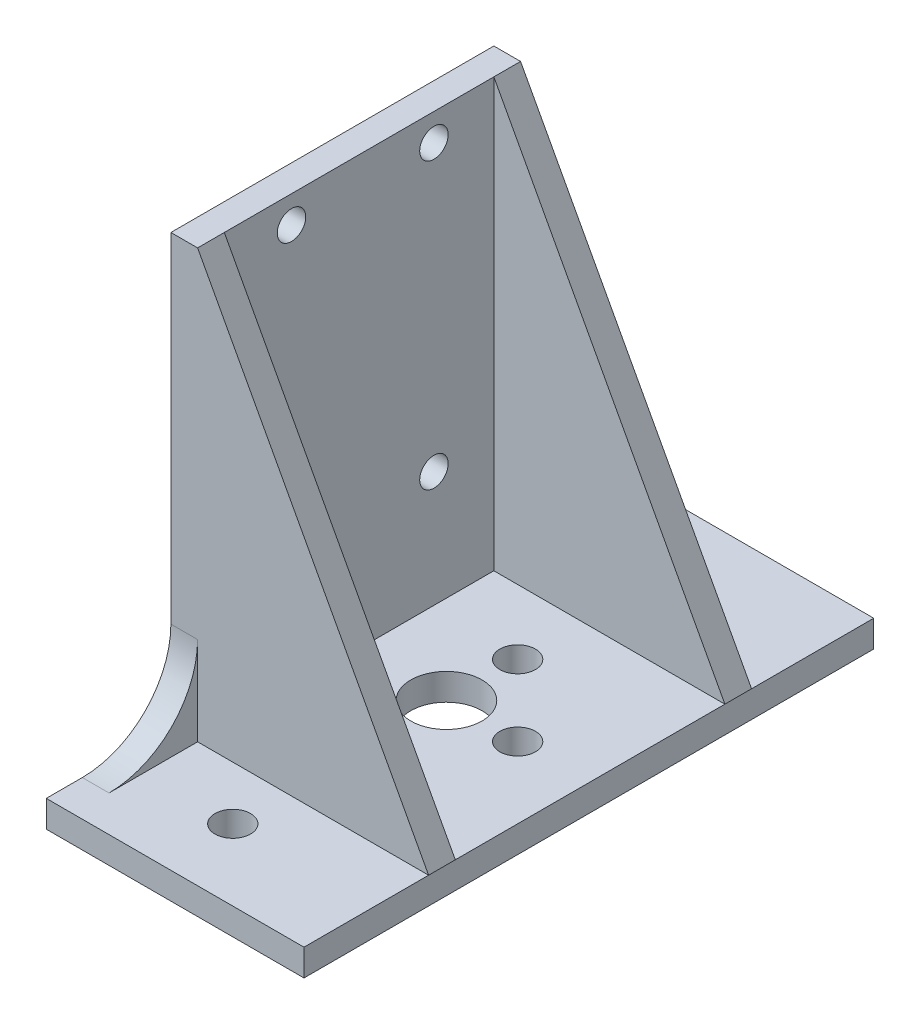
ISO-10303-21;
HEADER;
FILE_DESCRIPTION(('STEP AP214'),'2;1');
FILE_NAME('part.step','',(''),(''),'','','');
FILE_SCHEMA(('AUTOMOTIVE_DESIGN { 1 0 10303 214 1 1 1 1 }'));
ENDSEC;
DATA;
#1=APPLICATION_CONTEXT('core data for automotive mechanical design processes');
#2=APPLICATION_PROTOCOL_DEFINITION('international standard','automotive_design',2000,#1);
#3=PRODUCT_CONTEXT('',#1,'mechanical');
#4=PRODUCT('Part','Part','',(#3));
#5=PRODUCT_RELATED_PRODUCT_CATEGORY('part','',(#4));
#6=PRODUCT_DEFINITION_FORMATION('','',#4);
#7=PRODUCT_DEFINITION_CONTEXT('part definition',#1,'design');
#8=PRODUCT_DEFINITION('design','',#6,#7);
#9=PRODUCT_DEFINITION_SHAPE('','',#8);
#10=(LENGTH_UNIT() NAMED_UNIT(*) SI_UNIT(.MILLI.,.METRE.));
#11=(NAMED_UNIT(*) PLANE_ANGLE_UNIT() SI_UNIT($,.RADIAN.));
#12=(NAMED_UNIT(*) SI_UNIT($,.STERADIAN.) SOLID_ANGLE_UNIT());
#13=UNCERTAINTY_MEASURE_WITH_UNIT(LENGTH_MEASURE(1.E-05),#10,'distance_accuracy_value','');
#14=(GEOMETRIC_REPRESENTATION_CONTEXT(3) GLOBAL_UNCERTAINTY_ASSIGNED_CONTEXT((#13)) GLOBAL_UNIT_ASSIGNED_CONTEXT((#10,
#11,#12)) REPRESENTATION_CONTEXT('',''));
#15=CARTESIAN_POINT('',(0.,0.,0.));
#16=DIRECTION('',(0.,0.,1.));
#17=DIRECTION('',(1.,0.,0.));
#18=AXIS2_PLACEMENT_3D('',#15,#16,#17);
#19=CARTESIAN_POINT('',(0.,3.,0.));
#20=DIRECTION('',(0.,1.,0.));
#21=DIRECTION('',(0.,0.,1.));
#22=AXIS2_PLACEMENT_3D('',#19,#20,#21);
#23=PLANE('',#22);
#24=CARTESIAN_POINT('',(0.,3.,8.));
#25=DIRECTION('',(0.,1.,0.));
#26=DIRECTION('',(0.,0.,1.));
#27=AXIS2_PLACEMENT_3D('',#24,#25,#26);
#28=CIRCLE('',#27,2.);
#29=CARTESIAN_POINT('',(0.,3.,10.));
#30=VERTEX_POINT('',#29);
#31=EDGE_CURVE('E221',#30,#30,#28,.T.);
#32=ORIENTED_EDGE('',*,*,#31,.F.);
#33=EDGE_LOOP('',(#32));
#34=FACE_BOUND('',#33,.T.);
#35=CARTESIAN_POINT('',(8.,3.,0.));
#36=DIRECTION('',(0.,1.,0.));
#37=DIRECTION('',(0.,0.,1.));
#38=AXIS2_PLACEMENT_3D('',#35,#36,#37);
#39=CIRCLE('',#38,2.);
#40=CARTESIAN_POINT('',(8.,3.,2.));
#41=VERTEX_POINT('',#40);
#42=EDGE_CURVE('E215',#41,#41,#39,.T.);
#43=ORIENTED_EDGE('',*,*,#42,.F.);
#44=EDGE_LOOP('',(#43));
#45=FACE_BOUND('',#44,.T.);
#46=CARTESIAN_POINT('',(0.,3.,-8.));
#47=DIRECTION('',(0.,1.,0.));
#48=DIRECTION('',(0.,0.,1.));
#49=AXIS2_PLACEMENT_3D('',#46,#47,#48);
#50=CIRCLE('',#49,2.);
#51=CARTESIAN_POINT('',(0.,3.,-6.));
#52=VERTEX_POINT('',#51);
#53=EDGE_CURVE('E210',#52,#52,#50,.T.);
#54=ORIENTED_EDGE('',*,*,#53,.F.);
#55=EDGE_LOOP('',(#54));
#56=FACE_BOUND('',#55,.T.);
#57=CARTESIAN_POINT('',(0.,3.,0.));
#58=DIRECTION('',(0.,1.,0.));
#59=DIRECTION('',(0.,0.,1.));
#60=AXIS2_PLACEMENT_3D('',#57,#58,#59);
#61=CIRCLE('',#60,4.);
#62=CARTESIAN_POINT('',(0.,3.,4.));
#63=VERTEX_POINT('',#62);
#64=EDGE_CURVE('E203',#63,#63,#61,.T.);
#65=ORIENTED_EDGE('',*,*,#64,.F.);
#66=EDGE_LOOP('',(#65));
#67=FACE_BOUND('',#66,.T.);
#68=DIRECTION('',(0.,0.,1.));
#69=VECTOR('',#68,1.);
#70=CARTESIAN_POINT('',(16.,3.,0.));
#71=LINE('',#70,#69);
#72=CARTESIAN_POINT('',(16.,2.99999999999999,-15.278));
#73=VERTEX_POINT('',#72);
#74=CARTESIAN_POINT('',(16.,3.,15.));
#75=VERTEX_POINT('',#74);
#76=EDGE_CURVE('E194',#73,#75,#71,.T.);
#77=ORIENTED_EDGE('',*,*,#76,.F.);
#78=DIRECTION('',(-1.,0.,0.));
#79=VECTOR('',#78,1.);
#80=CARTESIAN_POINT('',(0.,3.,-15.278));
#81=LINE('',#80,#79);
#82=CARTESIAN_POINT('',(-9.95,3.,-15.278));
#83=VERTEX_POINT('',#82);
#84=EDGE_CURVE('E161',#73,#83,#81,.T.);
#85=ORIENTED_EDGE('',*,*,#84,.T.);
#86=DIRECTION('',(0.,0.,-1.));
#87=VECTOR('',#86,1.);
#88=CARTESIAN_POINT('',(-9.95,3.,0.));
#89=LINE('',#88,#87);
#90=CARTESIAN_POINT('',(-9.95,3.,15.));
#91=VERTEX_POINT('',#90);
#92=EDGE_CURVE('E237',#91,#83,#89,.T.);
#93=ORIENTED_EDGE('',*,*,#92,.F.);
#94=DIRECTION('',(1.,0.,0.));
#95=VECTOR('',#94,1.);
#96=CARTESIAN_POINT('',(0.,3.,15.));
#97=LINE('',#96,#95);
#98=EDGE_CURVE('E55',#91,#75,#97,.T.);
#99=ORIENTED_EDGE('',*,*,#98,.T.);
#100=EDGE_LOOP('',(#77,#85,#93,#99));
#101=FACE_BOUND('',#100,.T.);
#102=ADVANCED_FACE('F39',(#34,#45,#56,#67,#101),#23,.T.);
#103=CARTESIAN_POINT('',(-9.95,12.95,-28.228));
#104=DIRECTION('',(1.,0.,0.));
#105=DIRECTION('',(0.,0.,-1.));
#106=AXIS2_PLACEMENT_3D('',#103,#104,#105);
#107=PLANE('',#106);
#108=CARTESIAN_POINT('',(-9.95,48.,7.45199999999999));
#109=DIRECTION('',(-1.,0.,0.));
#110=DIRECTION('',(0.,0.,1.));
#111=AXIS2_PLACEMENT_3D('',#108,#109,#110);
#112=CIRCLE('',#111,1.6);
#113=CARTESIAN_POINT('',(-9.95,48.,9.05199999999999));
#114=VERTEX_POINT('',#113);
#115=EDGE_CURVE('E310',#114,#114,#112,.T.);
#116=ORIENTED_EDGE('',*,*,#115,.T.);
#117=EDGE_LOOP('',(#116));
#118=FACE_BOUND('',#117,.T.);
#119=CARTESIAN_POINT('',(-9.95,16.,7.45199999999999));
#120=DIRECTION('',(-1.,0.,0.));
#121=DIRECTION('',(0.,0.,1.));
#122=AXIS2_PLACEMENT_3D('',#119,#120,#121);
#123=CIRCLE('',#122,1.6);
#124=CARTESIAN_POINT('',(-9.95,16.,9.052));
#125=VERTEX_POINT('',#124);
#126=EDGE_CURVE('E302',#125,#125,#123,.T.);
#127=ORIENTED_EDGE('',*,*,#126,.T.);
#128=EDGE_LOOP('',(#127));
#129=FACE_BOUND('',#128,.T.);
#130=CARTESIAN_POINT('',(-9.95,16.,-8.54800000000001));
#131=DIRECTION('',(-1.,0.,0.));
#132=DIRECTION('',(0.,0.,1.));
#133=AXIS2_PLACEMENT_3D('',#130,#131,#132);
#134=CIRCLE('',#133,1.6);
#135=CARTESIAN_POINT('',(-9.95,16.,-6.94800000000001));
#136=VERTEX_POINT('',#135);
#137=EDGE_CURVE('E294',#136,#136,#134,.T.);
#138=ORIENTED_EDGE('',*,*,#137,.T.);
#139=EDGE_LOOP('',(#138));
#140=FACE_BOUND('',#139,.T.);
#141=CARTESIAN_POINT('',(-9.95,48.,-8.54800000000001));
#142=DIRECTION('',(-1.,0.,0.));
#143=DIRECTION('',(0.,0.,1.));
#144=AXIS2_PLACEMENT_3D('',#141,#142,#143);
#145=CIRCLE('',#144,1.6);
#146=CARTESIAN_POINT('',(-9.95,48.,-6.94800000000001));
#147=VERTEX_POINT('',#146);
#148=EDGE_CURVE('E277',#147,#147,#145,.T.);
#149=ORIENTED_EDGE('',*,*,#148,.T.);
#150=EDGE_LOOP('',(#149));
#151=FACE_BOUND('',#150,.T.);
#152=ORIENTED_EDGE('',*,*,#92,.T.);
#153=DIRECTION('',(0.,1.,0.));
#154=VECTOR('',#153,1.);
#155=CARTESIAN_POINT('',(-9.95,12.95,-15.278));
#156=LINE('',#155,#154);
#157=CARTESIAN_POINT('',(-9.95,51.05,-15.278));
#158=VERTEX_POINT('',#157);
#159=EDGE_CURVE('E185',#83,#158,#156,.T.);
#160=ORIENTED_EDGE('',*,*,#159,.T.);
#161=DIRECTION('',(0.,0.,-1.));
#162=VECTOR('',#161,1.);
#163=CARTESIAN_POINT('',(-9.95,51.05,-18.278));
#164=LINE('',#163,#162);
#165=CARTESIAN_POINT('',(-9.95,51.05,15.));
#166=VERTEX_POINT('',#165);
#167=EDGE_CURVE('E281',#166,#158,#164,.T.);
#168=ORIENTED_EDGE('',*,*,#167,.F.);
#169=DIRECTION('',(0.,-1.,0.));
#170=VECTOR('',#169,1.);
#171=CARTESIAN_POINT('',(-9.95,12.95,15.));
#172=LINE('',#171,#170);
#173=EDGE_CURVE('E48',#166,#91,#172,.T.);
#174=ORIENTED_EDGE('',*,*,#173,.T.);
#175=EDGE_LOOP('',(#152,#160,#168,#174));
#176=FACE_BOUND('',#175,.T.);
#177=ADVANCED_FACE('F406',(#118,#129,#140,#151,#176),#107,.T.);
#178=DIRECTION('',(-1.,0.,0.));
#179=VECTOR('',#178,1.);
#180=CARTESIAN_POINT('',(0.,3.,-18.278));
#181=LINE('',#180,#179);
#182=CARTESIAN_POINT('',(16.,2.99999999999999,-18.278));
#183=VERTEX_POINT('',#182);
#184=CARTESIAN_POINT('',(-9.95,3.,-18.278));
#185=VERTEX_POINT('',#184);
#186=EDGE_CURVE('E168',#183,#185,#181,.T.);
#187=ORIENTED_EDGE('',*,*,#186,.F.);
#188=CARTESIAN_POINT('',(16.,3.,-32.));
#189=VERTEX_POINT('',#188);
#190=EDGE_CURVE('E181',#189,#183,#71,.T.);
#191=ORIENTED_EDGE('',*,*,#190,.F.);
#192=DIRECTION('',(1.,0.,0.));
#193=VECTOR('',#192,1.);
#194=CARTESIAN_POINT('',(0.,3.,-32.));
#195=LINE('',#194,#193);
#196=CARTESIAN_POINT('',(-12.95,3.,-32.));
#197=VERTEX_POINT('',#196);
#198=EDGE_CURVE('E193',#197,#189,#195,.T.);
#199=ORIENTED_EDGE('',*,*,#198,.F.);
#200=DIRECTION('',(0.,0.,1.));
#201=VECTOR('',#200,1.);
#202=CARTESIAN_POINT('',(-12.95,3.,0.));
#203=LINE('',#202,#201);
#204=CARTESIAN_POINT('',(-12.95,3.,-28.228));
#205=VERTEX_POINT('',#204);
#206=EDGE_CURVE('E434',#197,#205,#203,.T.);
#207=ORIENTED_EDGE('',*,*,#206,.T.);
#208=DIRECTION('',(-1.,0.,0.));
#209=VECTOR('',#208,1.);
#210=CARTESIAN_POINT('',(-9.95,3.,-28.228));
#211=LINE('',#210,#209);
#212=CARTESIAN_POINT('',(-9.95,3.,-28.228));
#213=VERTEX_POINT('',#212);
#214=EDGE_CURVE('E241',#213,#205,#211,.T.);
#215=ORIENTED_EDGE('',*,*,#214,.F.);
#216=EDGE_CURVE('E183',#185,#213,#89,.T.);
#217=ORIENTED_EDGE('',*,*,#216,.F.);
#218=EDGE_LOOP('',(#187,#191,#199,#207,#215,#217));
#219=FACE_BOUND('',#218,.T.);
#220=CARTESIAN_POINT('',(0.,3.,-24.));
#221=DIRECTION('',(0.,1.,0.));
#222=DIRECTION('',(0.,0.,1.));
#223=AXIS2_PLACEMENT_3D('',#220,#221,#222);
#224=CIRCLE('',#223,2.);
#225=CARTESIAN_POINT('',(0.,3.,-22.));
#226=VERTEX_POINT('',#225);
#227=EDGE_CURVE('E225',#226,#226,#224,.T.);
#228=ORIENTED_EDGE('',*,*,#227,.F.);
#229=EDGE_LOOP('',(#228));
#230=FACE_BOUND('',#229,.T.);
#231=ADVANCED_FACE('F178',(#219,#230),#23,.T.);
#232=DIRECTION('',(0.,1.,0.));
#233=VECTOR('',#232,1.);
#234=CARTESIAN_POINT('',(-9.95,12.95,-18.278));
#235=LINE('',#234,#233);
#236=CARTESIAN_POINT('',(-9.95,12.95,-18.278));
#237=VERTEX_POINT('',#236);
#238=EDGE_CURVE('E173',#185,#237,#235,.T.);
#239=ORIENTED_EDGE('',*,*,#238,.F.);
#240=ORIENTED_EDGE('',*,*,#216,.T.);
#241=CARTESIAN_POINT('',(-9.95,12.95,-28.228));
#242=DIRECTION('',(1.,0.,0.));
#243=DIRECTION('',(0.,0.,-1.));
#244=AXIS2_PLACEMENT_3D('',#241,#242,#243);
#245=CIRCLE('',#244,9.95);
#246=EDGE_CURVE('E260',#237,#213,#245,.T.);
#247=ORIENTED_EDGE('',*,*,#246,.F.);
#248=EDGE_LOOP('',(#239,#240,#247));
#249=FACE_BOUND('',#248,.T.);
#250=ADVANCED_FACE('F456',(#249),#107,.T.);
#251=CARTESIAN_POINT('',(16.,3.,0.));
#252=DIRECTION('',(1.,0.,0.));
#253=DIRECTION('',(0.,0.,-1.));
#254=AXIS2_PLACEMENT_3D('',#251,#252,#253);
#255=PLANE('',#254);
#256=ORIENTED_EDGE('',*,*,#190,.T.);
#257=DIRECTION('',(0.,0.,1.));
#258=VECTOR('',#257,1.);
#259=CARTESIAN_POINT('',(16.,3.,0.));
#260=LINE('',#259,#258);
#261=EDGE_CURVE('E149',#183,#73,#260,.T.);
#262=ORIENTED_EDGE('',*,*,#261,.T.);
#263=ORIENTED_EDGE('',*,*,#76,.T.);
#264=DIRECTION('',(0.,0.,1.));
#265=VECTOR('',#264,1.);
#266=CARTESIAN_POINT('',(16.,3.,0.));
#267=LINE('',#266,#265);
#268=CARTESIAN_POINT('',(16.,3.,18.));
#269=VERTEX_POINT('',#268);
#270=EDGE_CURVE('E318',#269,#75,#267,.F.);
#271=ORIENTED_EDGE('',*,*,#270,.F.);
#272=CARTESIAN_POINT('',(16.,3.,32.));
#273=VERTEX_POINT('',#272);
#274=EDGE_CURVE('E196',#269,#273,#71,.T.);
#275=ORIENTED_EDGE('',*,*,#274,.T.);
#276=DIRECTION('',(0.,-1.,0.));
#277=VECTOR('',#276,1.);
#278=CARTESIAN_POINT('',(16.,3.,32.));
#279=LINE('',#278,#277);
#280=CARTESIAN_POINT('',(16.,0.,32.));
#281=VERTEX_POINT('',#280);
#282=EDGE_CURVE('E391',#273,#281,#279,.T.);
#283=ORIENTED_EDGE('',*,*,#282,.T.);
#284=DIRECTION('',(0.,0.,1.));
#285=VECTOR('',#284,1.);
#286=CARTESIAN_POINT('',(16.,0.,0.));
#287=LINE('',#286,#285);
#288=CARTESIAN_POINT('',(16.,0.,-32.));
#289=VERTEX_POINT('',#288);
#290=EDGE_CURVE('E374',#289,#281,#287,.T.);
#291=ORIENTED_EDGE('',*,*,#290,.F.);
#292=DIRECTION('',(0.,-1.,0.));
#293=VECTOR('',#292,1.);
#294=CARTESIAN_POINT('',(16.,3.,-32.));
#295=LINE('',#294,#293);
#296=EDGE_CURVE('E191',#189,#289,#295,.T.);
#297=ORIENTED_EDGE('',*,*,#296,.F.);
#298=EDGE_LOOP('',(#256,#262,#263,#271,#275,#283,#291,#297));
#299=FACE_BOUND('',#298,.T.);
#300=ADVANCED_FACE('F188',(#299),#255,.T.);
#301=CARTESIAN_POINT('',(0.,3.,-32.));
#302=DIRECTION('',(0.,0.,-1.));
#303=DIRECTION('',(-1.,0.,0.));
#304=AXIS2_PLACEMENT_3D('',#301,#302,#303);
#305=PLANE('',#304);
#306=ORIENTED_EDGE('',*,*,#296,.T.);
#307=DIRECTION('',(1.,0.,0.));
#308=VECTOR('',#307,1.);
#309=CARTESIAN_POINT('',(0.,0.,-32.));
#310=LINE('',#309,#308);
#311=CARTESIAN_POINT('',(-12.95,0.,-32.));
#312=VERTEX_POINT('',#311);
#313=EDGE_CURVE('E377',#312,#289,#310,.T.);
#314=ORIENTED_EDGE('',*,*,#313,.F.);
#315=DIRECTION('',(0.,-1.,0.));
#316=VECTOR('',#315,1.);
#317=CARTESIAN_POINT('',(-12.95,3.,-32.));
#318=LINE('',#317,#316);
#319=EDGE_CURVE('E398',#197,#312,#318,.T.);
#320=ORIENTED_EDGE('',*,*,#319,.F.);
#321=ORIENTED_EDGE('',*,*,#198,.T.);
#322=EDGE_LOOP('',(#306,#314,#320,#321));
#323=FACE_BOUND('',#322,.T.);
#324=ADVANCED_FACE('F448',(#323),#305,.T.);
#325=CARTESIAN_POINT('',(-12.95,3.,0.));
#326=DIRECTION('',(1.,0.,0.));
#327=DIRECTION('',(0.,0.,-1.));
#328=AXIS2_PLACEMENT_3D('',#325,#326,#327);
#329=PLANE('',#328);
#330=DIRECTION('',(0.,0.,1.));
#331=VECTOR('',#330,1.);
#332=CARTESIAN_POINT('',(-12.95,0.,0.));
#333=LINE('',#332,#331);
#334=CARTESIAN_POINT('',(-12.95,0.,32.));
#335=VERTEX_POINT('',#334);
#336=EDGE_CURVE('E380',#312,#335,#333,.T.);
#337=ORIENTED_EDGE('',*,*,#336,.T.);
#338=DIRECTION('',(0.,-1.,0.));
#339=VECTOR('',#338,1.);
#340=CARTESIAN_POINT('',(-12.95,3.,32.));
#341=LINE('',#340,#339);
#342=CARTESIAN_POINT('',(-12.95,3.,32.));
#343=VERTEX_POINT('',#342);
#344=EDGE_CURVE('E394',#343,#335,#341,.T.);
#345=ORIENTED_EDGE('',*,*,#344,.F.);
#346=CARTESIAN_POINT('',(-12.95,3.,27.95));
#347=VERTEX_POINT('',#346);
#348=EDGE_CURVE('E199',#347,#343,#203,.T.);
#349=ORIENTED_EDGE('',*,*,#348,.F.);
#350=CARTESIAN_POINT('',(-12.95,12.95,27.95));
#351=DIRECTION('',(1.,0.,0.));
#352=DIRECTION('',(0.,0.,-1.));
#353=AXIS2_PLACEMENT_3D('',#350,#351,#352);
#354=CIRCLE('',#353,9.95);
#355=CARTESIAN_POINT('',(-12.95,12.95,18.));
#356=VERTEX_POINT('',#355);
#357=EDGE_CURVE('E265',#347,#356,#354,.T.);
#358=ORIENTED_EDGE('',*,*,#357,.T.);
#359=DIRECTION('',(0.,1.,0.));
#360=VECTOR('',#359,1.);
#361=CARTESIAN_POINT('',(-12.95,51.05,18.));
#362=LINE('',#361,#360);
#363=CARTESIAN_POINT('',(-12.95,51.05,18.));
#364=VERTEX_POINT('',#363);
#365=EDGE_CURVE('E261',#356,#364,#362,.T.);
#366=ORIENTED_EDGE('',*,*,#365,.T.);
#367=DIRECTION('',(0.,0.,-1.));
#368=VECTOR('',#367,1.);
#369=CARTESIAN_POINT('',(-12.95,51.05,-18.278));
#370=LINE('',#369,#368);
#371=CARTESIAN_POINT('',(-12.95,51.05,-18.278));
#372=VERTEX_POINT('',#371);
#373=EDGE_CURVE('E257',#364,#372,#370,.T.);
#374=ORIENTED_EDGE('',*,*,#373,.T.);
#375=DIRECTION('',(0.,-1.,0.));
#376=VECTOR('',#375,1.);
#377=CARTESIAN_POINT('',(-12.95,51.05,-18.278));
#378=LINE('',#377,#376);
#379=CARTESIAN_POINT('',(-12.95,12.95,-18.278));
#380=VERTEX_POINT('',#379);
#381=EDGE_CURVE('E273',#372,#380,#378,.T.);
#382=ORIENTED_EDGE('',*,*,#381,.T.);
#383=CARTESIAN_POINT('',(-12.95,12.95,-28.228));
#384=DIRECTION('',(1.,0.,0.));
#385=DIRECTION('',(0.,0.,-1.));
#386=AXIS2_PLACEMENT_3D('',#383,#384,#385);
#387=CIRCLE('',#386,9.95);
#388=EDGE_CURVE('E269',#380,#205,#387,.T.);
#389=ORIENTED_EDGE('',*,*,#388,.T.);
#390=ORIENTED_EDGE('',*,*,#206,.F.);
#391=ORIENTED_EDGE('',*,*,#319,.T.);
#392=EDGE_LOOP('',(#337,#345,#349,#358,#366,#374,#382,#389,#390,#391));
#393=FACE_BOUND('',#392,.T.);
#394=CARTESIAN_POINT('',(-12.95,48.,7.45199999999999));
#395=DIRECTION('',(-1.,0.,0.));
#396=DIRECTION('',(0.,0.,1.));
#397=AXIS2_PLACEMENT_3D('',#394,#395,#396);
#398=CIRCLE('',#397,1.6);
#399=CARTESIAN_POINT('',(-12.95,48.,9.05199999999999));
#400=VERTEX_POINT('',#399);
#401=EDGE_CURVE('E314',#400,#400,#398,.T.);
#402=ORIENTED_EDGE('',*,*,#401,.F.);
#403=EDGE_LOOP('',(#402));
#404=FACE_BOUND('',#403,.T.);
#405=CARTESIAN_POINT('',(-12.95,16.,7.45199999999999));
#406=DIRECTION('',(-1.,0.,0.));
#407=DIRECTION('',(0.,0.,1.));
#408=AXIS2_PLACEMENT_3D('',#405,#406,#407);
#409=CIRCLE('',#408,1.6);
#410=CARTESIAN_POINT('',(-12.95,16.,9.052));
#411=VERTEX_POINT('',#410);
#412=EDGE_CURVE('E306',#411,#411,#409,.T.);
#413=ORIENTED_EDGE('',*,*,#412,.F.);
#414=EDGE_LOOP('',(#413));
#415=FACE_BOUND('',#414,.T.);
#416=CARTESIAN_POINT('',(-12.95,16.,-8.54800000000001));
#417=DIRECTION('',(-1.,0.,0.));
#418=DIRECTION('',(0.,0.,1.));
#419=AXIS2_PLACEMENT_3D('',#416,#417,#418);
#420=CIRCLE('',#419,1.6);
#421=CARTESIAN_POINT('',(-12.95,16.,-6.94800000000001));
#422=VERTEX_POINT('',#421);
#423=EDGE_CURVE('E298',#422,#422,#420,.T.);
#424=ORIENTED_EDGE('',*,*,#423,.F.);
#425=EDGE_LOOP('',(#424));
#426=FACE_BOUND('',#425,.T.);
#427=CARTESIAN_POINT('',(-12.95,48.,-8.54800000000001));
#428=DIRECTION('',(-1.,0.,0.));
#429=DIRECTION('',(0.,0.,1.));
#430=AXIS2_PLACEMENT_3D('',#427,#428,#429);
#431=CIRCLE('',#430,1.6);
#432=CARTESIAN_POINT('',(-12.95,48.,-6.94800000000001));
#433=VERTEX_POINT('',#432);
#434=EDGE_CURVE('E290',#433,#433,#431,.T.);
#435=ORIENTED_EDGE('',*,*,#434,.F.);
#436=EDGE_LOOP('',(#435));
#437=FACE_BOUND('',#436,.T.);
#438=ADVANCED_FACE('F439',(#393,#404,#415,#426,#437),#329,.F.);
#439=CARTESIAN_POINT('',(0.,3.,0.));
#440=DIRECTION('',(0.,-1.,0.));
#441=DIRECTION('',(0.,0.,-1.));
#442=AXIS2_PLACEMENT_3D('',#439,#440,#441);
#443=CYLINDRICAL_SURFACE('',#442,4.);
#444=ORIENTED_EDGE('',*,*,#64,.T.);
#445=EDGE_LOOP('',(#444));
#446=FACE_BOUND('',#445,.T.);
#447=CARTESIAN_POINT('',(0.,0.,0.));
#448=DIRECTION('',(0.,1.,0.));
#449=DIRECTION('',(0.,0.,1.));
#450=AXIS2_PLACEMENT_3D('',#447,#448,#449);
#451=CIRCLE('',#450,4.);
#452=CARTESIAN_POINT('',(0.,0.,4.));
#453=VERTEX_POINT('',#452);
#454=EDGE_CURVE('E370',#453,#453,#451,.T.);
#455=ORIENTED_EDGE('',*,*,#454,.F.);
#456=EDGE_LOOP('',(#455));
#457=FACE_BOUND('',#456,.T.);
#458=ADVANCED_FACE('F493',(#446,#457),#443,.F.);
#459=CARTESIAN_POINT('',(0.,3.,-8.));
#460=DIRECTION('',(0.,-1.,0.));
#461=DIRECTION('',(0.,0.,-1.));
#462=AXIS2_PLACEMENT_3D('',#459,#460,#461);
#463=CYLINDRICAL_SURFACE('',#462,2.);
#464=ORIENTED_EDGE('',*,*,#53,.T.);
#465=EDGE_LOOP('',(#464));
#466=FACE_BOUND('',#465,.T.);
#467=CARTESIAN_POINT('',(0.,0.,-8.));
#468=DIRECTION('',(0.,1.,0.));
#469=DIRECTION('',(0.,0.,1.));
#470=AXIS2_PLACEMENT_3D('',#467,#468,#469);
#471=CIRCLE('',#470,2.);
#472=CARTESIAN_POINT('',(0.,0.,-6.));
#473=VERTEX_POINT('',#472);
#474=EDGE_CURVE('E366',#473,#473,#471,.T.);
#475=ORIENTED_EDGE('',*,*,#474,.F.);
#476=EDGE_LOOP('',(#475));
#477=FACE_BOUND('',#476,.T.);
#478=ADVANCED_FACE('F498',(#466,#477),#463,.F.);
#479=CARTESIAN_POINT('',(8.,3.,0.));
#480=DIRECTION('',(0.,-1.,0.));
#481=DIRECTION('',(0.,0.,-1.));
#482=AXIS2_PLACEMENT_3D('',#479,#480,#481);
#483=CYLINDRICAL_SURFACE('',#482,2.);
#484=ORIENTED_EDGE('',*,*,#42,.T.);
#485=EDGE_LOOP('',(#484));
#486=FACE_BOUND('',#485,.T.);
#487=CARTESIAN_POINT('',(8.,0.,0.));
#488=DIRECTION('',(0.,1.,0.));
#489=DIRECTION('',(0.,0.,1.));
#490=AXIS2_PLACEMENT_3D('',#487,#488,#489);
#491=CIRCLE('',#490,2.);
#492=CARTESIAN_POINT('',(8.,0.,2.));
#493=VERTEX_POINT('',#492);
#494=EDGE_CURVE('E362',#493,#493,#491,.T.);
#495=ORIENTED_EDGE('',*,*,#494,.F.);
#496=EDGE_LOOP('',(#495));
#497=FACE_BOUND('',#496,.T.);
#498=ADVANCED_FACE('F501',(#486,#497),#483,.F.);
#499=CARTESIAN_POINT('',(0.,3.,8.));
#500=DIRECTION('',(0.,-1.,0.));
#501=DIRECTION('',(0.,0.,-1.));
#502=AXIS2_PLACEMENT_3D('',#499,#500,#501);
#503=CYLINDRICAL_SURFACE('',#502,2.);
#504=ORIENTED_EDGE('',*,*,#31,.T.);
#505=EDGE_LOOP('',(#504));
#506=FACE_BOUND('',#505,.T.);
#507=CARTESIAN_POINT('',(0.,0.,8.));
#508=DIRECTION('',(0.,1.,0.));
#509=DIRECTION('',(0.,0.,1.));
#510=AXIS2_PLACEMENT_3D('',#507,#508,#509);
#511=CIRCLE('',#510,2.);
#512=CARTESIAN_POINT('',(0.,0.,10.));
#513=VERTEX_POINT('',#512);
#514=EDGE_CURVE('E358',#513,#513,#511,.T.);
#515=ORIENTED_EDGE('',*,*,#514,.F.);
#516=EDGE_LOOP('',(#515));
#517=FACE_BOUND('',#516,.T.);
#518=ADVANCED_FACE('F505',(#506,#517),#503,.F.);
#519=CARTESIAN_POINT('',(0.,3.,-24.));
#520=DIRECTION('',(0.,-1.,0.));
#521=DIRECTION('',(0.,0.,-1.));
#522=AXIS2_PLACEMENT_3D('',#519,#520,#521);
#523=CYLINDRICAL_SURFACE('',#522,2.);
#524=ORIENTED_EDGE('',*,*,#227,.T.);
#525=EDGE_LOOP('',(#524));
#526=FACE_BOUND('',#525,.T.);
#527=CARTESIAN_POINT('',(0.,0.,-24.));
#528=DIRECTION('',(0.,1.,0.));
#529=DIRECTION('',(0.,0.,1.));
#530=AXIS2_PLACEMENT_3D('',#527,#528,#529);
#531=CIRCLE('',#530,2.);
#532=CARTESIAN_POINT('',(0.,0.,-22.));
#533=VERTEX_POINT('',#532);
#534=EDGE_CURVE('E354',#533,#533,#531,.T.);
#535=ORIENTED_EDGE('',*,*,#534,.F.);
#536=EDGE_LOOP('',(#535));
#537=FACE_BOUND('',#536,.T.);
#538=ADVANCED_FACE('F488',(#526,#537),#523,.F.);
#539=CARTESIAN_POINT('',(0.,3.,24.));
#540=DIRECTION('',(0.,-1.,0.));
#541=DIRECTION('',(0.,0.,-1.));
#542=AXIS2_PLACEMENT_3D('',#539,#540,#541);
#543=CYLINDRICAL_SURFACE('',#542,2.);
#544=CARTESIAN_POINT('',(0.,3.,24.));
#545=DIRECTION('',(0.,1.,0.));
#546=DIRECTION('',(0.,0.,1.));
#547=AXIS2_PLACEMENT_3D('',#544,#545,#546);
#548=CIRCLE('',#547,2.);
#549=CARTESIAN_POINT('',(0.,3.,26.));
#550=VERTEX_POINT('',#549);
#551=EDGE_CURVE('E229',#550,#550,#548,.F.);
#552=ORIENTED_EDGE('',*,*,#551,.F.);
#553=EDGE_LOOP('',(#552));
#554=FACE_BOUND('',#553,.T.);
#555=CARTESIAN_POINT('',(0.,0.,24.));
#556=DIRECTION('',(0.,1.,0.));
#557=DIRECTION('',(0.,0.,1.));
#558=AXIS2_PLACEMENT_3D('',#555,#556,#557);
#559=CIRCLE('',#558,2.);
#560=CARTESIAN_POINT('',(0.,0.,26.));
#561=VERTEX_POINT('',#560);
#562=EDGE_CURVE('E236',#561,#561,#559,.F.);
#563=ORIENTED_EDGE('',*,*,#562,.T.);
#564=EDGE_LOOP('',(#563));
#565=FACE_BOUND('',#564,.T.);
#566=ADVANCED_FACE('F41',(#554,#565),#543,.F.);
#567=CARTESIAN_POINT('',(0.,3.,32.));
#568=DIRECTION('',(0.,0.,-1.));
#569=DIRECTION('',(-1.,0.,0.));
#570=AXIS2_PLACEMENT_3D('',#567,#568,#569);
#571=PLANE('',#570);
#572=ORIENTED_EDGE('',*,*,#282,.F.);
#573=DIRECTION('',(1.,0.,0.));
#574=VECTOR('',#573,1.);
#575=CARTESIAN_POINT('',(0.,3.,32.));
#576=LINE('',#575,#574);
#577=EDGE_CURVE('E395',#343,#273,#576,.T.);
#578=ORIENTED_EDGE('',*,*,#577,.F.);
#579=ORIENTED_EDGE('',*,*,#344,.T.);
#580=DIRECTION('',(1.,0.,0.));
#581=VECTOR('',#580,1.);
#582=CARTESIAN_POINT('',(0.,0.,32.));
#583=LINE('',#582,#581);
#584=EDGE_CURVE('E233',#335,#281,#583,.T.);
#585=ORIENTED_EDGE('',*,*,#584,.T.);
#586=EDGE_LOOP('',(#572,#578,#579,#585));
#587=FACE_BOUND('',#586,.T.);
#588=ADVANCED_FACE('F436',(#587),#571,.F.);
#589=DIRECTION('',(1.,0.,0.));
#590=VECTOR('',#589,1.);
#591=CARTESIAN_POINT('',(0.,3.,18.));
#592=LINE('',#591,#590);
#593=CARTESIAN_POINT('',(-9.95,3.,18.));
#594=VERTEX_POINT('',#593);
#595=EDGE_CURVE('E325',#594,#269,#592,.T.);
#596=ORIENTED_EDGE('',*,*,#595,.F.);
#597=CARTESIAN_POINT('',(-9.95,3.,27.95));
#598=VERTEX_POINT('',#597);
#599=EDGE_CURVE('E63',#598,#594,#89,.T.);
#600=ORIENTED_EDGE('',*,*,#599,.F.);
#601=DIRECTION('',(-1.,0.,0.));
#602=VECTOR('',#601,1.);
#603=CARTESIAN_POINT('',(-9.95,3.,27.95));
#604=LINE('',#603,#602);
#605=EDGE_CURVE('E246',#598,#347,#604,.T.);
#606=ORIENTED_EDGE('',*,*,#605,.T.);
#607=ORIENTED_EDGE('',*,*,#348,.T.);
#608=ORIENTED_EDGE('',*,*,#577,.T.);
#609=ORIENTED_EDGE('',*,*,#274,.F.);
#610=EDGE_LOOP('',(#596,#600,#606,#607,#608,#609));
#611=FACE_BOUND('',#610,.T.);
#612=ORIENTED_EDGE('',*,*,#551,.T.);
#613=EDGE_LOOP('',(#612));
#614=FACE_BOUND('',#613,.T.);
#615=ADVANCED_FACE('F422',(#611,#614),#23,.T.);
#616=CARTESIAN_POINT('',(0.,0.,0.));
#617=DIRECTION('',(0.,1.,0.));
#618=DIRECTION('',(0.,0.,1.));
#619=AXIS2_PLACEMENT_3D('',#616,#617,#618);
#620=PLANE('',#619);
#621=ORIENTED_EDGE('',*,*,#290,.T.);
#622=ORIENTED_EDGE('',*,*,#584,.F.);
#623=ORIENTED_EDGE('',*,*,#336,.F.);
#624=ORIENTED_EDGE('',*,*,#313,.T.);
#625=EDGE_LOOP('',(#621,#622,#623,#624));
#626=FACE_BOUND('',#625,.T.);
#627=ORIENTED_EDGE('',*,*,#534,.T.);
#628=EDGE_LOOP('',(#627));
#629=FACE_BOUND('',#628,.T.);
#630=ORIENTED_EDGE('',*,*,#514,.T.);
#631=EDGE_LOOP('',(#630));
#632=FACE_BOUND('',#631,.T.);
#633=ORIENTED_EDGE('',*,*,#494,.T.);
#634=EDGE_LOOP('',(#633));
#635=FACE_BOUND('',#634,.T.);
#636=ORIENTED_EDGE('',*,*,#474,.T.);
#637=EDGE_LOOP('',(#636));
#638=FACE_BOUND('',#637,.T.);
#639=ORIENTED_EDGE('',*,*,#454,.T.);
#640=EDGE_LOOP('',(#639));
#641=FACE_BOUND('',#640,.T.);
#642=ORIENTED_EDGE('',*,*,#562,.F.);
#643=EDGE_LOOP('',(#642));
#644=FACE_BOUND('',#643,.T.);
#645=ADVANCED_FACE('F445',(#626,#629,#632,#635,#638,#641,#644),#620,.F.);
#646=CARTESIAN_POINT('',(-9.95,51.05,-18.278));
#647=DIRECTION('',(0.,0.,-1.));
#648=DIRECTION('',(0.,1.,0.));
#649=AXIS2_PLACEMENT_3D('',#646,#647,#648);
#650=PLANE('',#649);
#651=ORIENTED_EDGE('',*,*,#381,.F.);
#652=DIRECTION('',(-1.,0.,0.));
#653=VECTOR('',#652,1.);
#654=CARTESIAN_POINT('',(-9.95,51.05,-18.278));
#655=LINE('',#654,#653);
#656=CARTESIAN_POINT('',(-9.95,51.05,-18.278));
#657=VERTEX_POINT('',#656);
#658=EDGE_CURVE('E171',#657,#372,#655,.T.);
#659=ORIENTED_EDGE('',*,*,#658,.F.);
#660=DIRECTION('',(0.475191447028493,-0.87988242889091,0.));
#661=VECTOR('',#660,1.);
#662=CARTESIAN_POINT('',(-9.95,51.05,-18.278));
#663=LINE('',#662,#661);
#664=EDGE_CURVE('E152',#657,#183,#663,.T.);
#665=ORIENTED_EDGE('',*,*,#664,.T.);
#666=ORIENTED_EDGE('',*,*,#186,.T.);
#667=ORIENTED_EDGE('',*,*,#238,.T.);
#668=DIRECTION('',(-1.,0.,0.));
#669=VECTOR('',#668,1.);
#670=CARTESIAN_POINT('',(-9.95,12.95,-18.278));
#671=LINE('',#670,#669);
#672=EDGE_CURVE('E238',#237,#380,#671,.T.);
#673=ORIENTED_EDGE('',*,*,#672,.T.);
#674=EDGE_LOOP('',(#651,#659,#665,#666,#667,#673));
#675=FACE_BOUND('',#674,.T.);
#676=ADVANCED_FACE('F167',(#675),#650,.T.);
#677=CARTESIAN_POINT('',(-9.95,51.05,-18.278));
#678=DIRECTION('',(0.,1.,0.));
#679=DIRECTION('',(0.,0.,1.));
#680=AXIS2_PLACEMENT_3D('',#677,#678,#679);
#681=PLANE('',#680);
#682=ORIENTED_EDGE('',*,*,#658,.T.);
#683=ORIENTED_EDGE('',*,*,#373,.F.);
#684=DIRECTION('',(-1.,0.,0.));
#685=VECTOR('',#684,1.);
#686=CARTESIAN_POINT('',(-9.95,51.05,18.));
#687=LINE('',#686,#685);
#688=CARTESIAN_POINT('',(-9.95,51.05,18.));
#689=VERTEX_POINT('',#688);
#690=EDGE_CURVE('E252',#689,#364,#687,.T.);
#691=ORIENTED_EDGE('',*,*,#690,.F.);
#692=EDGE_CURVE('E242',#689,#166,#164,.T.);
#693=ORIENTED_EDGE('',*,*,#692,.T.);
#694=ORIENTED_EDGE('',*,*,#167,.T.);
#695=EDGE_CURVE('E282',#158,#657,#164,.T.);
#696=ORIENTED_EDGE('',*,*,#695,.T.);
#697=EDGE_LOOP('',(#682,#683,#691,#693,#694,#696));
#698=FACE_BOUND('',#697,.T.);
#699=ADVANCED_FACE('F412',(#698),#681,.T.);
#700=CARTESIAN_POINT('',(-9.95,51.05,18.));
#701=DIRECTION('',(0.,0.,1.));
#702=DIRECTION('',(0.,-1.,0.));
#703=AXIS2_PLACEMENT_3D('',#700,#701,#702);
#704=PLANE('',#703);
#705=ORIENTED_EDGE('',*,*,#365,.F.);
#706=DIRECTION('',(-1.,0.,0.));
#707=VECTOR('',#706,1.);
#708=CARTESIAN_POINT('',(-9.95,12.95,18.));
#709=LINE('',#708,#707);
#710=CARTESIAN_POINT('',(-9.95,12.95,18.));
#711=VERTEX_POINT('',#710);
#712=EDGE_CURVE('E249',#711,#356,#709,.T.);
#713=ORIENTED_EDGE('',*,*,#712,.F.);
#714=DIRECTION('',(0.,-1.,0.));
#715=VECTOR('',#714,1.);
#716=CARTESIAN_POINT('',(-9.95,12.95,18.));
#717=LINE('',#716,#715);
#718=EDGE_CURVE('E11',#711,#594,#717,.T.);
#719=ORIENTED_EDGE('',*,*,#718,.T.);
#720=ORIENTED_EDGE('',*,*,#595,.T.);
#721=DIRECTION('',(0.475191447028493,-0.87988242889091,0.));
#722=VECTOR('',#721,1.);
#723=CARTESIAN_POINT('',(-9.95,51.05,18.));
#724=LINE('',#723,#722);
#725=EDGE_CURVE('E330',#689,#269,#724,.T.);
#726=ORIENTED_EDGE('',*,*,#725,.F.);
#727=ORIENTED_EDGE('',*,*,#690,.T.);
#728=EDGE_LOOP('',(#705,#713,#719,#720,#726,#727));
#729=FACE_BOUND('',#728,.T.);
#730=ADVANCED_FACE('F420',(#729),#704,.T.);
#731=CARTESIAN_POINT('',(-9.95,12.95,27.95));
#732=DIRECTION('',(-1.,0.,0.));
#733=DIRECTION('',(0.,0.,1.));
#734=AXIS2_PLACEMENT_3D('',#731,#732,#733);
#735=CYLINDRICAL_SURFACE('',#734,9.95);
#736=ORIENTED_EDGE('',*,*,#357,.F.);
#737=ORIENTED_EDGE('',*,*,#605,.F.);
#738=CARTESIAN_POINT('',(-9.95,12.95,27.95));
#739=DIRECTION('',(1.,0.,0.));
#740=DIRECTION('',(0.,0.,-1.));
#741=AXIS2_PLACEMENT_3D('',#738,#739,#740);
#742=CIRCLE('',#741,9.95);
#743=EDGE_CURVE('E283',#598,#711,#742,.T.);
#744=ORIENTED_EDGE('',*,*,#743,.T.);
#745=ORIENTED_EDGE('',*,*,#712,.T.);
#746=EDGE_LOOP('',(#736,#737,#744,#745));
#747=FACE_BOUND('',#746,.T.);
#748=ADVANCED_FACE('F429',(#747),#735,.F.);
#749=CARTESIAN_POINT('',(-9.95,12.95,-28.228));
#750=DIRECTION('',(-1.,0.,0.));
#751=DIRECTION('',(0.,0.,1.));
#752=AXIS2_PLACEMENT_3D('',#749,#750,#751);
#753=CYLINDRICAL_SURFACE('',#752,9.95);
#754=ORIENTED_EDGE('',*,*,#388,.F.);
#755=ORIENTED_EDGE('',*,*,#672,.F.);
#756=ORIENTED_EDGE('',*,*,#246,.T.);
#757=ORIENTED_EDGE('',*,*,#214,.T.);
#758=EDGE_LOOP('',(#754,#755,#756,#757));
#759=FACE_BOUND('',#758,.T.);
#760=ADVANCED_FACE('F452',(#759),#753,.F.);
#761=ORIENTED_EDGE('',*,*,#718,.F.);
#762=ORIENTED_EDGE('',*,*,#743,.F.);
#763=ORIENTED_EDGE('',*,*,#599,.T.);
#764=EDGE_LOOP('',(#761,#762,#763));
#765=FACE_BOUND('',#764,.T.);
#766=ADVANCED_FACE('F426',(#765),#107,.T.);
#767=CARTESIAN_POINT('',(-9.95,48.,-8.54800000000001));
#768=DIRECTION('',(-1.,0.,0.));
#769=DIRECTION('',(0.,0.,1.));
#770=AXIS2_PLACEMENT_3D('',#767,#768,#769);
#771=CYLINDRICAL_SURFACE('',#770,1.6);
#772=ORIENTED_EDGE('',*,*,#148,.F.);
#773=EDGE_LOOP('',(#772));
#774=FACE_BOUND('',#773,.T.);
#775=ORIENTED_EDGE('',*,*,#434,.T.);
#776=EDGE_LOOP('',(#775));
#777=FACE_BOUND('',#776,.T.);
#778=ADVANCED_FACE('F468',(#774,#777),#771,.F.);
#779=CARTESIAN_POINT('',(-9.95,16.,-8.54800000000001));
#780=DIRECTION('',(-1.,0.,0.));
#781=DIRECTION('',(0.,0.,1.));
#782=AXIS2_PLACEMENT_3D('',#779,#780,#781);
#783=CYLINDRICAL_SURFACE('',#782,1.6);
#784=ORIENTED_EDGE('',*,*,#137,.F.);
#785=EDGE_LOOP('',(#784));
#786=FACE_BOUND('',#785,.T.);
#787=ORIENTED_EDGE('',*,*,#423,.T.);
#788=EDGE_LOOP('',(#787));
#789=FACE_BOUND('',#788,.T.);
#790=ADVANCED_FACE('F559',(#786,#789),#783,.F.);
#791=CARTESIAN_POINT('',(-9.95,16.,7.45199999999999));
#792=DIRECTION('',(-1.,0.,0.));
#793=DIRECTION('',(0.,0.,1.));
#794=AXIS2_PLACEMENT_3D('',#791,#792,#793);
#795=CYLINDRICAL_SURFACE('',#794,1.6);
#796=ORIENTED_EDGE('',*,*,#126,.F.);
#797=EDGE_LOOP('',(#796));
#798=FACE_BOUND('',#797,.T.);
#799=ORIENTED_EDGE('',*,*,#412,.T.);
#800=EDGE_LOOP('',(#799));
#801=FACE_BOUND('',#800,.T.);
#802=ADVANCED_FACE('F569',(#798,#801),#795,.F.);
#803=CARTESIAN_POINT('',(-9.95,48.,7.45199999999999));
#804=DIRECTION('',(-1.,0.,0.));
#805=DIRECTION('',(0.,0.,1.));
#806=AXIS2_PLACEMENT_3D('',#803,#804,#805);
#807=CYLINDRICAL_SURFACE('',#806,1.6);
#808=ORIENTED_EDGE('',*,*,#115,.F.);
#809=EDGE_LOOP('',(#808));
#810=FACE_BOUND('',#809,.T.);
#811=ORIENTED_EDGE('',*,*,#401,.T.);
#812=EDGE_LOOP('',(#811));
#813=FACE_BOUND('',#812,.T.);
#814=ADVANCED_FACE('F579',(#810,#813),#807,.F.);
#815=CARTESIAN_POINT('',(-9.95,51.05,18.));
#816=DIRECTION('',(-0.87988242889091,-0.475191447028493,0.));
#817=DIRECTION('',(0.475191447028493,-0.87988242889091,0.));
#818=AXIS2_PLACEMENT_3D('',#815,#816,#817);
#819=PLANE('',#818);
#820=ORIENTED_EDGE('',*,*,#725,.T.);
#821=ORIENTED_EDGE('',*,*,#270,.T.);
#822=DIRECTION('',(0.475191447028493,-0.87988242889091,0.));
#823=VECTOR('',#822,1.);
#824=CARTESIAN_POINT('',(-9.95,51.05,15.));
#825=LINE('',#824,#823);
#826=EDGE_CURVE('E160',#166,#75,#825,.T.);
#827=ORIENTED_EDGE('',*,*,#826,.F.);
#828=ORIENTED_EDGE('',*,*,#692,.F.);
#829=EDGE_LOOP('',(#820,#821,#827,#828));
#830=FACE_BOUND('',#829,.T.);
#831=ADVANCED_FACE('F417',(#830),#819,.F.);
#832=CARTESIAN_POINT('',(1.525,25.525,15.));
#833=DIRECTION('',(0.,0.,1.));
#834=DIRECTION('',(1.,0.,0.));
#835=AXIS2_PLACEMENT_3D('',#832,#833,#834);
#836=PLANE('',#835);
#837=ORIENTED_EDGE('',*,*,#98,.F.);
#838=ORIENTED_EDGE('',*,*,#173,.F.);
#839=ORIENTED_EDGE('',*,*,#826,.T.);
#840=EDGE_LOOP('',(#837,#838,#839));
#841=FACE_BOUND('',#840,.T.);
#842=ADVANCED_FACE('F629',(#841),#836,.F.);
#843=CARTESIAN_POINT('',(-9.95,51.05,-18.278));
#844=DIRECTION('',(0.87988242889091,0.475191447028493,0.));
#845=DIRECTION('',(0.475191447028493,-0.87988242889091,0.));
#846=AXIS2_PLACEMENT_3D('',#843,#844,#845);
#847=PLANE('',#846);
#848=ORIENTED_EDGE('',*,*,#261,.F.);
#849=ORIENTED_EDGE('',*,*,#664,.F.);
#850=ORIENTED_EDGE('',*,*,#695,.F.);
#851=DIRECTION('',(0.475191447028493,-0.87988242889091,0.));
#852=VECTOR('',#851,1.);
#853=CARTESIAN_POINT('',(-9.95,51.05,-15.278));
#854=LINE('',#853,#852);
#855=EDGE_CURVE('E155',#158,#73,#854,.T.);
#856=ORIENTED_EDGE('',*,*,#855,.T.);
#857=EDGE_LOOP('',(#848,#849,#850,#856));
#858=FACE_BOUND('',#857,.T.);
#859=ADVANCED_FACE('F151',(#858),#847,.T.);
#860=CARTESIAN_POINT('',(1.52500000000001,25.525,-15.278));
#861=DIRECTION('',(0.,0.,-1.));
#862=DIRECTION('',(0.,1.,0.));
#863=AXIS2_PLACEMENT_3D('',#860,#861,#862);
#864=PLANE('',#863);
#865=ORIENTED_EDGE('',*,*,#84,.F.);
#866=ORIENTED_EDGE('',*,*,#855,.F.);
#867=ORIENTED_EDGE('',*,*,#159,.F.);
#868=EDGE_LOOP('',(#865,#866,#867));
#869=FACE_BOUND('',#868,.T.);
#870=ADVANCED_FACE('F410',(#869),#864,.F.);
#871=CLOSED_SHELL('',(#102,#177,#231,#250,#300,#324,#438,#458,#478,#498,#518,#538,#566,#588,
#615,#645,#676,#699,#730,#748,#760,#766,#778,#790,#802,#814,#831,#842,#859,#870));
#872=MANIFOLD_SOLID_BREP('B2',#871);
#873=ADVANCED_BREP_SHAPE_REPRESENTATION('',(#18,#872),#14);
#874=SHAPE_DEFINITION_REPRESENTATION(#9,#873);
ENDSEC;
END-ISO-10303-21;
